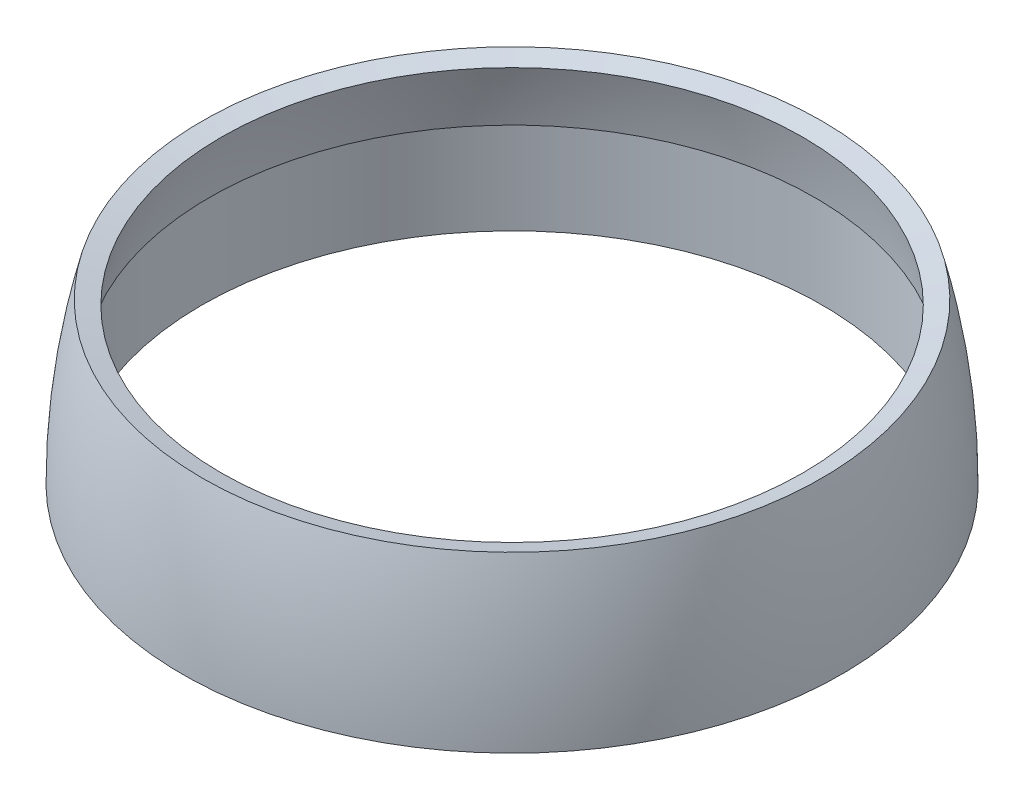
ISO-10303-21;
HEADER;
FILE_DESCRIPTION(('STEP AP214'),'2;1');
FILE_NAME('part.step','',(''),(''),'','','');
FILE_SCHEMA(('AUTOMOTIVE_DESIGN { 1 0 10303 214 1 1 1 1 }'));
ENDSEC;
DATA;
#1=APPLICATION_CONTEXT('core data for automotive mechanical design processes');
#2=APPLICATION_PROTOCOL_DEFINITION('international standard','automotive_design',2000,#1);
#3=PRODUCT_CONTEXT('',#1,'mechanical');
#4=PRODUCT('Part','Part','',(#3));
#5=PRODUCT_RELATED_PRODUCT_CATEGORY('part','',(#4));
#6=PRODUCT_DEFINITION_FORMATION('','',#4);
#7=PRODUCT_DEFINITION_CONTEXT('part definition',#1,'design');
#8=PRODUCT_DEFINITION('design','',#6,#7);
#9=PRODUCT_DEFINITION_SHAPE('','',#8);
#10=(LENGTH_UNIT() NAMED_UNIT(*) SI_UNIT(.MILLI.,.METRE.));
#11=(NAMED_UNIT(*) PLANE_ANGLE_UNIT() SI_UNIT($,.RADIAN.));
#12=(NAMED_UNIT(*) SI_UNIT($,.STERADIAN.) SOLID_ANGLE_UNIT());
#13=UNCERTAINTY_MEASURE_WITH_UNIT(LENGTH_MEASURE(1.E-05),#10,'distance_accuracy_value','');
#14=(GEOMETRIC_REPRESENTATION_CONTEXT(3) GLOBAL_UNCERTAINTY_ASSIGNED_CONTEXT((#13)) GLOBAL_UNIT_ASSIGNED_CONTEXT((#10,
#11,#12)) REPRESENTATION_CONTEXT('',''));
#15=CARTESIAN_POINT('',(0.,0.,0.));
#16=DIRECTION('',(0.,0.,1.));
#17=DIRECTION('',(1.,0.,0.));
#18=AXIS2_PLACEMENT_3D('',#15,#16,#17);
#19=CARTESIAN_POINT('',(0.,0.,0.));
#20=DIRECTION('',(0.,-1.,0.));
#21=DIRECTION('',(0.,0.,-1.));
#22=AXIS2_PLACEMENT_3D('',#19,#20,#21);
#23=DEGENERATE_TOROIDAL_SURFACE('',#22,16.5,32.5,.F.);
#24=CARTESIAN_POINT('',(0.,8.,0.));
#25=DIRECTION('',(0.,-1.,0.));
#26=DIRECTION('',(0.,0.,-1.));
#27=AXIS2_PLACEMENT_3D('',#24,#25,#26);
#28=CIRCLE('',#27,15.);
#29=CARTESIAN_POINT('',(0.,8.,-15.));
#30=VERTEX_POINT('',#29);
#31=EDGE_CURVE('E10',#30,#30,#28,.T.);
#32=ORIENTED_EDGE('',*,*,#31,.F.);
#33=EDGE_LOOP('',(#32));
#34=FACE_BOUND('',#33,.T.);
#35=CARTESIAN_POINT('',(0.,5.,0.));
#36=DIRECTION('',(0.,-1.,0.));
#37=DIRECTION('',(1.,0.,0.));
#38=AXIS2_PLACEMENT_3D('',#35,#36,#37);
#39=CIRCLE('',#38,15.6130814466628);
#40=CARTESIAN_POINT('',(15.6130814466628,5.,0.));
#41=VERTEX_POINT('',#40);
#42=EDGE_CURVE('E35',#41,#41,#39,.T.);
#43=ORIENTED_EDGE('',*,*,#42,.T.);
#44=EDGE_LOOP('',(#43));
#45=FACE_BOUND('',#44,.T.);
#46=ADVANCED_FACE('F32',(#34,#45),#23,.T.);
#47=CARTESIAN_POINT('',(0.,8.,0.));
#48=DIRECTION('',(0.,1.,0.));
#49=DIRECTION('',(0.,0.,1.));
#50=AXIS2_PLACEMENT_3D('',#47,#48,#49);
#51=CONICAL_SURFACE('',#50,15.,1.32208633770137);
#52=CARTESIAN_POINT('',(0.,8.24615384615385,0.));
#53=DIRECTION('',(0.,-1.,0.));
#54=DIRECTION('',(0.,0.,-1.));
#55=AXIS2_PLACEMENT_3D('',#52,#53,#54);
#56=CIRCLE('',#55,15.9692307692308);
#57=CARTESIAN_POINT('',(0.,8.24615384615385,-15.9692307692308));
#58=VERTEX_POINT('',#57);
#59=EDGE_CURVE('E39',#58,#58,#56,.T.);
#60=ORIENTED_EDGE('',*,*,#59,.F.);
#61=EDGE_LOOP('',(#60));
#62=FACE_BOUND('',#61,.T.);
#63=ORIENTED_EDGE('',*,*,#31,.T.);
#64=EDGE_LOOP('',(#63));
#65=FACE_BOUND('',#64,.T.);
#66=ADVANCED_FACE('F69',(#62,#65),#51,.F.);
#67=CARTESIAN_POINT('',(0.,0.,0.));
#68=DIRECTION('',(0.,-1.,0.));
#69=DIRECTION('',(0.,0.,-1.));
#70=AXIS2_PLACEMENT_3D('',#67,#68,#69);
#71=DEGENERATE_TOROIDAL_SURFACE('',#70,16.5,33.5,.F.);
#72=CARTESIAN_POINT('',(0.,0.,0.));
#73=DIRECTION('',(0.,-1.,0.));
#74=DIRECTION('',(0.,0.,-1.));
#75=AXIS2_PLACEMENT_3D('',#72,#73,#74);
#76=CIRCLE('',#75,17.);
#77=CARTESIAN_POINT('',(0.,0.,-17.));
#78=VERTEX_POINT('',#77);
#79=EDGE_CURVE('E43',#78,#78,#76,.T.);
#80=ORIENTED_EDGE('',*,*,#79,.F.);
#81=EDGE_LOOP('',(#80));
#82=FACE_BOUND('',#81,.T.);
#83=ORIENTED_EDGE('',*,*,#59,.T.);
#84=EDGE_LOOP('',(#83));
#85=FACE_BOUND('',#84,.T.);
#86=ADVANCED_FACE('F74',(#82,#85),#71,.F.);
#87=CARTESIAN_POINT('',(17.,0.,0.));
#88=DIRECTION('',(0.,1.,0.));
#89=DIRECTION('',(0.,0.,1.));
#90=AXIS2_PLACEMENT_3D('',#87,#88,#89);
#91=PLANE('',#90);
#92=CARTESIAN_POINT('',(0.,0.,0.));
#93=DIRECTION('',(0.,1.,0.));
#94=DIRECTION('',(-1.,0.,0.));
#95=AXIS2_PLACEMENT_3D('',#92,#93,#94);
#96=CIRCLE('',#95,16.);
#97=CARTESIAN_POINT('',(-16.,0.,0.));
#98=VERTEX_POINT('',#97);
#99=EDGE_CURVE('E51',#98,#98,#96,.T.);
#100=ORIENTED_EDGE('',*,*,#99,.T.);
#101=EDGE_LOOP('',(#100));
#102=FACE_BOUND('',#101,.T.);
#103=ORIENTED_EDGE('',*,*,#79,.T.);
#104=EDGE_LOOP('',(#103));
#105=FACE_BOUND('',#104,.T.);
#106=ADVANCED_FACE('F55',(#102,#105),#91,.F.);
#107=CARTESIAN_POINT('',(16.,5.,0.));
#108=DIRECTION('',(0.,-1.,0.));
#109=DIRECTION('',(1.,0.,0.));
#110=AXIS2_PLACEMENT_3D('',#107,#108,#109);
#111=PLANE('',#110);
#112=ORIENTED_EDGE('',*,*,#42,.F.);
#113=EDGE_LOOP('',(#112));
#114=FACE_BOUND('',#113,.T.);
#115=CARTESIAN_POINT('',(0.,5.,0.));
#116=DIRECTION('',(0.,1.,0.));
#117=DIRECTION('',(-1.,0.,0.));
#118=AXIS2_PLACEMENT_3D('',#115,#116,#117);
#119=CIRCLE('',#118,16.);
#120=CARTESIAN_POINT('',(-16.,5.,0.));
#121=VERTEX_POINT('',#120);
#122=EDGE_CURVE('E48',#121,#121,#119,.T.);
#123=ORIENTED_EDGE('',*,*,#122,.F.);
#124=EDGE_LOOP('',(#123));
#125=FACE_BOUND('',#124,.T.);
#126=ADVANCED_FACE('F60',(#114,#125),#111,.T.);
#127=CARTESIAN_POINT('',(0.,5.,0.));
#128=DIRECTION('',(0.,1.,0.));
#129=DIRECTION('',(-1.,0.,0.));
#130=AXIS2_PLACEMENT_3D('',#127,#128,#129);
#131=CYLINDRICAL_SURFACE('',#130,16.);
#132=ORIENTED_EDGE('',*,*,#122,.T.);
#133=EDGE_LOOP('',(#132));
#134=FACE_BOUND('',#133,.T.);
#135=ORIENTED_EDGE('',*,*,#99,.F.);
#136=EDGE_LOOP('',(#135));
#137=FACE_BOUND('',#136,.T.);
#138=ADVANCED_FACE('F58',(#134,#137),#131,.F.);
#139=CLOSED_SHELL('',(#46,#66,#86,#106,#126,#138));
#140=MANIFOLD_SOLID_BREP('B2',#139);
#141=ADVANCED_BREP_SHAPE_REPRESENTATION('',(#18,#140),#14);
#142=SHAPE_DEFINITION_REPRESENTATION(#9,#141);
ENDSEC;
END-ISO-10303-21;
